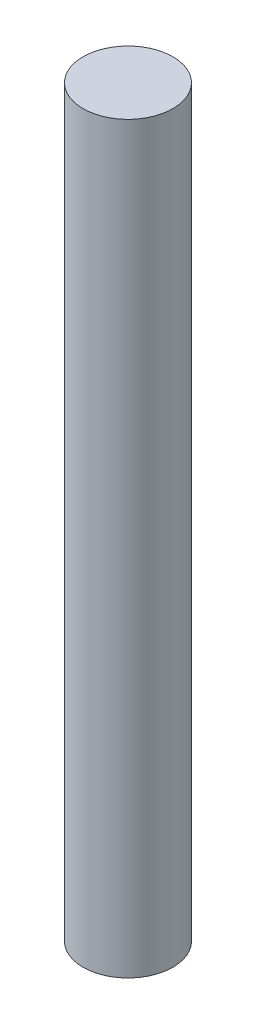
ISO-10303-21;
HEADER;
FILE_DESCRIPTION(('STEP AP214'),'2;1');
FILE_NAME('part.step','',(''),(''),'','','');
FILE_SCHEMA(('AUTOMOTIVE_DESIGN { 1 0 10303 214 1 1 1 1 }'));
ENDSEC;
DATA;
#1=APPLICATION_CONTEXT('core data for automotive mechanical design processes');
#2=APPLICATION_PROTOCOL_DEFINITION('international standard','automotive_design',2000,#1);
#3=PRODUCT_CONTEXT('',#1,'mechanical');
#4=PRODUCT('Part','Part','',(#3));
#5=PRODUCT_RELATED_PRODUCT_CATEGORY('part','',(#4));
#6=PRODUCT_DEFINITION_FORMATION('','',#4);
#7=PRODUCT_DEFINITION_CONTEXT('part definition',#1,'design');
#8=PRODUCT_DEFINITION('design','',#6,#7);
#9=PRODUCT_DEFINITION_SHAPE('','',#8);
#10=(LENGTH_UNIT() NAMED_UNIT(*) SI_UNIT(.MILLI.,.METRE.));
#11=(NAMED_UNIT(*) PLANE_ANGLE_UNIT() SI_UNIT($,.RADIAN.));
#12=(NAMED_UNIT(*) SI_UNIT($,.STERADIAN.) SOLID_ANGLE_UNIT());
#13=UNCERTAINTY_MEASURE_WITH_UNIT(LENGTH_MEASURE(1.E-05),#10,'distance_accuracy_value','');
#14=(GEOMETRIC_REPRESENTATION_CONTEXT(3) GLOBAL_UNCERTAINTY_ASSIGNED_CONTEXT((#13)) GLOBAL_UNIT_ASSIGNED_CONTEXT((#10,
#11,#12)) REPRESENTATION_CONTEXT('',''));
#15=CARTESIAN_POINT('',(0.,0.,0.));
#16=DIRECTION('',(0.,0.,1.));
#17=DIRECTION('',(1.,0.,0.));
#18=AXIS2_PLACEMENT_3D('',#15,#16,#17);
#19=CARTESIAN_POINT('',(0.,24.,0.));
#20=DIRECTION('',(0.,-1.,0.));
#21=DIRECTION('',(0.,0.,-1.));
#22=AXIS2_PLACEMENT_3D('',#19,#20,#21);
#23=CYLINDRICAL_SURFACE('',#22,1.45);
#24=CARTESIAN_POINT('',(0.,24.,0.));
#25=DIRECTION('',(0.,1.,0.));
#26=DIRECTION('',(0.,0.,1.));
#27=AXIS2_PLACEMENT_3D('',#24,#25,#26);
#28=CIRCLE('',#27,1.45);
#29=CARTESIAN_POINT('',(0.,24.,1.45));
#30=VERTEX_POINT('',#29);
#31=EDGE_CURVE('E10',#30,#30,#28,.T.);
#32=ORIENTED_EDGE('',*,*,#31,.F.);
#33=EDGE_LOOP('',(#32));
#34=FACE_BOUND('',#33,.T.);
#35=CARTESIAN_POINT('',(0.,0.,0.));
#36=DIRECTION('',(0.,1.,0.));
#37=DIRECTION('',(0.,0.,1.));
#38=AXIS2_PLACEMENT_3D('',#35,#36,#37);
#39=CIRCLE('',#38,1.45);
#40=CARTESIAN_POINT('',(0.,0.,1.45));
#41=VERTEX_POINT('',#40);
#42=EDGE_CURVE('E40',#41,#41,#39,.T.);
#43=ORIENTED_EDGE('',*,*,#42,.T.);
#44=EDGE_LOOP('',(#43));
#45=FACE_BOUND('',#44,.T.);
#46=ADVANCED_FACE('F37',(#34,#45),#23,.T.);
#47=CARTESIAN_POINT('',(0.,24.,0.));
#48=DIRECTION('',(0.,1.,0.));
#49=DIRECTION('',(0.,0.,1.));
#50=AXIS2_PLACEMENT_3D('',#47,#48,#49);
#51=PLANE('',#50);
#52=ORIENTED_EDGE('',*,*,#31,.T.);
#53=EDGE_LOOP('',(#52));
#54=FACE_BOUND('',#53,.T.);
#55=ADVANCED_FACE('F54',(#54),#51,.T.);
#56=CARTESIAN_POINT('',(0.,0.,0.));
#57=DIRECTION('',(0.,1.,0.));
#58=DIRECTION('',(0.,0.,1.));
#59=AXIS2_PLACEMENT_3D('',#56,#57,#58);
#60=PLANE('',#59);
#61=ORIENTED_EDGE('',*,*,#42,.F.);
#62=EDGE_LOOP('',(#61));
#63=FACE_BOUND('',#62,.T.);
#64=ADVANCED_FACE('F52',(#63),#60,.F.);
#65=CLOSED_SHELL('',(#46,#55,#64));
#66=MANIFOLD_SOLID_BREP('B2',#65);
#67=ADVANCED_BREP_SHAPE_REPRESENTATION('',(#18,#66),#14);
#68=SHAPE_DEFINITION_REPRESENTATION(#9,#67);
ENDSEC;
END-ISO-10303-21;
